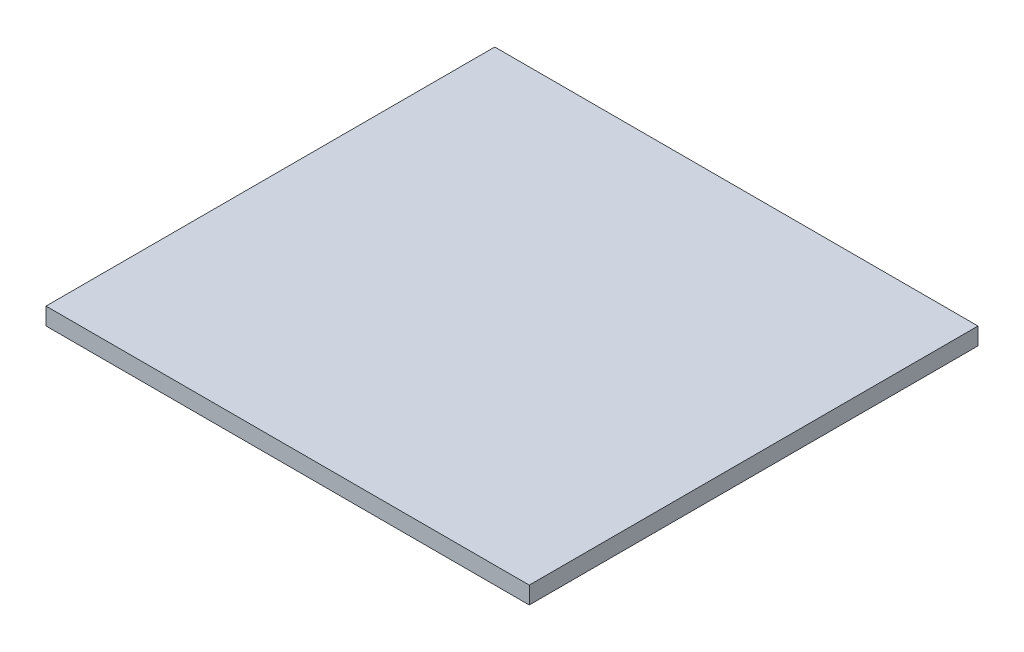
ISO-10303-21;
HEADER;
FILE_DESCRIPTION(('STEP AP214'),'2;1');
FILE_NAME('part.step','',(''),(''),'','','');
FILE_SCHEMA(('AUTOMOTIVE_DESIGN { 1 0 10303 214 1 1 1 1 }'));
ENDSEC;
DATA;
#1=APPLICATION_CONTEXT('core data for automotive mechanical design processes');
#2=APPLICATION_PROTOCOL_DEFINITION('international standard','automotive_design',2000,#1);
#3=PRODUCT_CONTEXT('',#1,'mechanical');
#4=PRODUCT('Part','Part','',(#3));
#5=PRODUCT_RELATED_PRODUCT_CATEGORY('part','',(#4));
#6=PRODUCT_DEFINITION_FORMATION('','',#4);
#7=PRODUCT_DEFINITION_CONTEXT('part definition',#1,'design');
#8=PRODUCT_DEFINITION('design','',#6,#7);
#9=PRODUCT_DEFINITION_SHAPE('','',#8);
#10=(LENGTH_UNIT() NAMED_UNIT(*) SI_UNIT(.MILLI.,.METRE.));
#11=(NAMED_UNIT(*) PLANE_ANGLE_UNIT() SI_UNIT($,.RADIAN.));
#12=(NAMED_UNIT(*) SI_UNIT($,.STERADIAN.) SOLID_ANGLE_UNIT());
#13=UNCERTAINTY_MEASURE_WITH_UNIT(LENGTH_MEASURE(1.E-05),#10,'distance_accuracy_value','');
#14=(GEOMETRIC_REPRESENTATION_CONTEXT(3) GLOBAL_UNCERTAINTY_ASSIGNED_CONTEXT((#13)) GLOBAL_UNIT_ASSIGNED_CONTEXT((#10,
#11,#12)) REPRESENTATION_CONTEXT('',''));
#15=CARTESIAN_POINT('',(0.,0.,0.));
#16=DIRECTION('',(0.,0.,1.));
#17=DIRECTION('',(1.,0.,0.));
#18=AXIS2_PLACEMENT_3D('',#15,#16,#17);
#19=CARTESIAN_POINT('',(62.695652173913,5.,-43.6739130434782));
#20=DIRECTION('',(-1.,0.,0.));
#21=DIRECTION('',(0.,0.,1.));
#22=AXIS2_PLACEMENT_3D('',#19,#20,#21);
#23=PLANE('',#22);
#24=DIRECTION('',(0.,0.,-1.));
#25=VECTOR('',#24,1.);
#26=CARTESIAN_POINT('',(62.695652173913,0.,-43.6739130434782));
#27=LINE('',#26,#25);
#28=CARTESIAN_POINT('',(62.695652173913,0.,86.3260869565218));
#29=VERTEX_POINT('',#28);
#30=CARTESIAN_POINT('',(62.695652173913,0.,-43.6739130434782));
#31=VERTEX_POINT('',#30);
#32=EDGE_CURVE('E96',#29,#31,#27,.T.);
#33=ORIENTED_EDGE('',*,*,#32,.T.);
#34=DIRECTION('',(0.,-1.,0.));
#35=VECTOR('',#34,1.);
#36=CARTESIAN_POINT('',(62.695652173913,5.,-43.6739130434782));
#37=LINE('',#36,#35);
#38=CARTESIAN_POINT('',(62.695652173913,5.,-43.6739130434782));
#39=VERTEX_POINT('',#38);
#40=EDGE_CURVE('E11',#39,#31,#37,.T.);
#41=ORIENTED_EDGE('',*,*,#40,.F.);
#42=DIRECTION('',(0.,0.,-1.));
#43=VECTOR('',#42,1.);
#44=CARTESIAN_POINT('',(62.695652173913,5.,-43.6739130434782));
#45=LINE('',#44,#43);
#46=CARTESIAN_POINT('',(62.695652173913,5.,86.3260869565218));
#47=VERTEX_POINT('',#46);
#48=EDGE_CURVE('E84',#47,#39,#45,.T.);
#49=ORIENTED_EDGE('',*,*,#48,.F.);
#50=DIRECTION('',(0.,-1.,0.));
#51=VECTOR('',#50,1.);
#52=CARTESIAN_POINT('',(62.695652173913,5.,86.3260869565218));
#53=LINE('',#52,#51);
#54=EDGE_CURVE('E92',#47,#29,#53,.T.);
#55=ORIENTED_EDGE('',*,*,#54,.T.);
#56=EDGE_LOOP('',(#33,#41,#49,#55));
#57=FACE_BOUND('',#56,.T.);
#58=ADVANCED_FACE('F33',(#57),#23,.F.);
#59=CARTESIAN_POINT('',(-77.304347826087,5.,-43.6739130434782));
#60=DIRECTION('',(0.,0.,1.));
#61=DIRECTION('',(1.,0.,0.));
#62=AXIS2_PLACEMENT_3D('',#59,#60,#61);
#63=PLANE('',#62);
#64=DIRECTION('',(-1.,0.,0.));
#65=VECTOR('',#64,1.);
#66=CARTESIAN_POINT('',(-77.304347826087,0.,-43.6739130434782));
#67=LINE('',#66,#65);
#68=CARTESIAN_POINT('',(-77.304347826087,0.,-43.6739130434782));
#69=VERTEX_POINT('',#68);
#70=EDGE_CURVE('E88',#31,#69,#67,.T.);
#71=ORIENTED_EDGE('',*,*,#70,.T.);
#72=DIRECTION('',(0.,-1.,0.));
#73=VECTOR('',#72,1.);
#74=CARTESIAN_POINT('',(-77.304347826087,5.,-43.6739130434782));
#75=LINE('',#74,#73);
#76=CARTESIAN_POINT('',(-77.304347826087,5.,-43.6739130434782));
#77=VERTEX_POINT('',#76);
#78=EDGE_CURVE('E41',#77,#69,#75,.T.);
#79=ORIENTED_EDGE('',*,*,#78,.F.);
#80=DIRECTION('',(-1.,0.,0.));
#81=VECTOR('',#80,1.);
#82=CARTESIAN_POINT('',(-77.304347826087,5.,-43.6739130434782));
#83=LINE('',#82,#81);
#84=EDGE_CURVE('E79',#39,#77,#83,.T.);
#85=ORIENTED_EDGE('',*,*,#84,.F.);
#86=ORIENTED_EDGE('',*,*,#40,.T.);
#87=EDGE_LOOP('',(#71,#79,#85,#86));
#88=FACE_BOUND('',#87,.T.);
#89=ADVANCED_FACE('F87',(#88),#63,.F.);
#90=CARTESIAN_POINT('',(-77.304347826087,5.,-43.6739130434782));
#91=DIRECTION('',(1.,0.,0.));
#92=DIRECTION('',(0.,0.,-1.));
#93=AXIS2_PLACEMENT_3D('',#90,#91,#92);
#94=PLANE('',#93);
#95=DIRECTION('',(0.,0.,1.));
#96=VECTOR('',#95,1.);
#97=CARTESIAN_POINT('',(-77.304347826087,0.,-43.6739130434782));
#98=LINE('',#97,#96);
#99=CARTESIAN_POINT('',(-77.304347826087,0.,86.3260869565218));
#100=VERTEX_POINT('',#99);
#101=EDGE_CURVE('E66',#69,#100,#98,.T.);
#102=ORIENTED_EDGE('',*,*,#101,.T.);
#103=DIRECTION('',(0.,-1.,0.));
#104=VECTOR('',#103,1.);
#105=CARTESIAN_POINT('',(-77.304347826087,5.,86.3260869565218));
#106=LINE('',#105,#104);
#107=CARTESIAN_POINT('',(-77.304347826087,5.,86.3260869565218));
#108=VERTEX_POINT('',#107);
#109=EDGE_CURVE('E89',#108,#100,#106,.T.);
#110=ORIENTED_EDGE('',*,*,#109,.F.);
#111=DIRECTION('',(0.,0.,1.));
#112=VECTOR('',#111,1.);
#113=CARTESIAN_POINT('',(-77.304347826087,5.,-43.6739130434782));
#114=LINE('',#113,#112);
#115=EDGE_CURVE('E82',#77,#108,#114,.T.);
#116=ORIENTED_EDGE('',*,*,#115,.F.);
#117=ORIENTED_EDGE('',*,*,#78,.T.);
#118=EDGE_LOOP('',(#102,#110,#116,#117));
#119=FACE_BOUND('',#118,.T.);
#120=ADVANCED_FACE('F90',(#119),#94,.F.);
#121=CARTESIAN_POINT('',(-77.304347826087,5.,86.3260869565218));
#122=DIRECTION('',(0.,0.,-1.));
#123=DIRECTION('',(-1.,0.,0.));
#124=AXIS2_PLACEMENT_3D('',#121,#122,#123);
#125=PLANE('',#124);
#126=DIRECTION('',(1.,0.,0.));
#127=VECTOR('',#126,1.);
#128=CARTESIAN_POINT('',(-77.304347826087,0.,86.3260869565218));
#129=LINE('',#128,#127);
#130=EDGE_CURVE('E72',#100,#29,#129,.T.);
#131=ORIENTED_EDGE('',*,*,#130,.T.);
#132=ORIENTED_EDGE('',*,*,#54,.F.);
#133=DIRECTION('',(1.,0.,0.));
#134=VECTOR('',#133,1.);
#135=CARTESIAN_POINT('',(-77.304347826087,5.,86.3260869565218));
#136=LINE('',#135,#134);
#137=EDGE_CURVE('E49',#108,#47,#136,.T.);
#138=ORIENTED_EDGE('',*,*,#137,.F.);
#139=ORIENTED_EDGE('',*,*,#109,.T.);
#140=EDGE_LOOP('',(#131,#132,#138,#139));
#141=FACE_BOUND('',#140,.T.);
#142=ADVANCED_FACE('F103',(#141),#125,.F.);
#143=CARTESIAN_POINT('',(0.,5.,0.));
#144=DIRECTION('',(0.,1.,0.));
#145=DIRECTION('',(0.,0.,1.));
#146=AXIS2_PLACEMENT_3D('',#143,#144,#145);
#147=PLANE('',#146);
#148=ORIENTED_EDGE('',*,*,#48,.T.);
#149=ORIENTED_EDGE('',*,*,#84,.T.);
#150=ORIENTED_EDGE('',*,*,#115,.T.);
#151=ORIENTED_EDGE('',*,*,#137,.T.);
#152=EDGE_LOOP('',(#148,#149,#150,#151));
#153=FACE_BOUND('',#152,.T.);
#154=ADVANCED_FACE('F80',(#153),#147,.T.);
#155=CARTESIAN_POINT('',(0.,0.,0.));
#156=DIRECTION('',(0.,1.,0.));
#157=DIRECTION('',(0.,0.,1.));
#158=AXIS2_PLACEMENT_3D('',#155,#156,#157);
#159=PLANE('',#158);
#160=ORIENTED_EDGE('',*,*,#32,.F.);
#161=ORIENTED_EDGE('',*,*,#130,.F.);
#162=ORIENTED_EDGE('',*,*,#101,.F.);
#163=ORIENTED_EDGE('',*,*,#70,.F.);
#164=EDGE_LOOP('',(#160,#161,#162,#163));
#165=FACE_BOUND('',#164,.T.);
#166=ADVANCED_FACE('F106',(#165),#159,.F.);
#167=CLOSED_SHELL('',(#58,#89,#120,#142,#154,#166));
#168=MANIFOLD_SOLID_BREP('B2',#167);
#169=ADVANCED_BREP_SHAPE_REPRESENTATION('',(#18,#168),#14);
#170=SHAPE_DEFINITION_REPRESENTATION(#9,#169);
ENDSEC;
END-ISO-10303-21;
